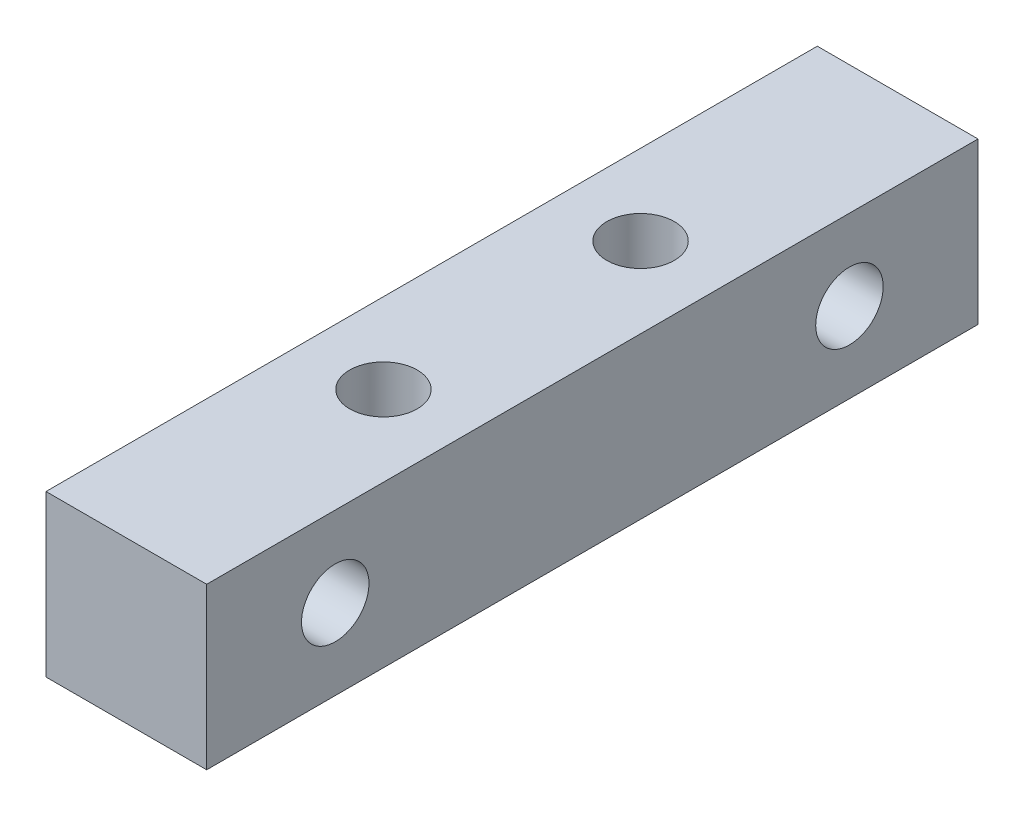
ISO-10303-21;
HEADER;
FILE_DESCRIPTION(('STEP AP214'),'2;1');
FILE_NAME('part.step','',(''),(''),'','','');
FILE_SCHEMA(('AUTOMOTIVE_DESIGN { 1 0 10303 214 1 1 1 1 }'));
ENDSEC;
DATA;
#1=APPLICATION_CONTEXT('core data for automotive mechanical design processes');
#2=APPLICATION_PROTOCOL_DEFINITION('international standard','automotive_design',2000,#1);
#3=PRODUCT_CONTEXT('',#1,'mechanical');
#4=PRODUCT('Part','Part','',(#3));
#5=PRODUCT_RELATED_PRODUCT_CATEGORY('part','',(#4));
#6=PRODUCT_DEFINITION_FORMATION('','',#4);
#7=PRODUCT_DEFINITION_CONTEXT('part definition',#1,'design');
#8=PRODUCT_DEFINITION('design','',#6,#7);
#9=PRODUCT_DEFINITION_SHAPE('','',#8);
#10=(LENGTH_UNIT() NAMED_UNIT(*) SI_UNIT(.MILLI.,.METRE.));
#11=(NAMED_UNIT(*) PLANE_ANGLE_UNIT() SI_UNIT($,.RADIAN.));
#12=(NAMED_UNIT(*) SI_UNIT($,.STERADIAN.) SOLID_ANGLE_UNIT());
#13=UNCERTAINTY_MEASURE_WITH_UNIT(LENGTH_MEASURE(1.E-05),#10,'distance_accuracy_value','');
#14=(GEOMETRIC_REPRESENTATION_CONTEXT(3) GLOBAL_UNCERTAINTY_ASSIGNED_CONTEXT((#13)) GLOBAL_UNIT_ASSIGNED_CONTEXT((#10,
#11,#12)) REPRESENTATION_CONTEXT('',''));
#15=CARTESIAN_POINT('',(0.,0.,0.));
#16=DIRECTION('',(0.,0.,1.));
#17=DIRECTION('',(1.,0.,0.));
#18=AXIS2_PLACEMENT_3D('',#15,#16,#17);
#19=CARTESIAN_POINT('',(0.,0.,48.));
#20=DIRECTION('',(1.,0.,0.));
#21=DIRECTION('',(0.,1.,0.));
#22=AXIS2_PLACEMENT_3D('',#19,#20,#21);
#23=PLANE('',#22);
#24=CARTESIAN_POINT('',(0.,-5.,40.));
#25=DIRECTION('',(1.,0.,0.));
#26=DIRECTION('',(0.,1.,0.));
#27=AXIS2_PLACEMENT_3D('',#24,#25,#26);
#28=CIRCLE('',#27,2.1);
#29=CARTESIAN_POINT('',(0.,-2.90000000000001,40.));
#30=VERTEX_POINT('',#29);
#31=EDGE_CURVE('E111',#30,#30,#28,.T.);
#32=ORIENTED_EDGE('',*,*,#31,.T.);
#33=EDGE_LOOP('',(#32));
#34=FACE_BOUND('',#33,.T.);
#35=CARTESIAN_POINT('',(0.,-5.,8.));
#36=DIRECTION('',(1.,0.,0.));
#37=DIRECTION('',(0.,1.,0.));
#38=AXIS2_PLACEMENT_3D('',#35,#36,#37);
#39=CIRCLE('',#38,2.1);
#40=CARTESIAN_POINT('',(0.,-2.90000000000001,8.));
#41=VERTEX_POINT('',#40);
#42=EDGE_CURVE('E131',#41,#41,#39,.T.);
#43=ORIENTED_EDGE('',*,*,#42,.T.);
#44=EDGE_LOOP('',(#43));
#45=FACE_BOUND('',#44,.T.);
#46=DIRECTION('',(0.,-1.,0.));
#47=VECTOR('',#46,1.);
#48=CARTESIAN_POINT('',(0.,0.,0.));
#49=LINE('',#48,#47);
#50=CARTESIAN_POINT('',(0.,0.,0.));
#51=VERTEX_POINT('',#50);
#52=CARTESIAN_POINT('',(0.,-10.,0.));
#53=VERTEX_POINT('',#52);
#54=EDGE_CURVE('E107',#51,#53,#49,.T.);
#55=ORIENTED_EDGE('',*,*,#54,.T.);
#56=DIRECTION('',(0.,0.,-1.));
#57=VECTOR('',#56,1.);
#58=CARTESIAN_POINT('',(0.,-10.,48.));
#59=LINE('',#58,#57);
#60=CARTESIAN_POINT('',(0.,-10.,48.));
#61=VERTEX_POINT('',#60);
#62=EDGE_CURVE('E11',#61,#53,#59,.T.);
#63=ORIENTED_EDGE('',*,*,#62,.F.);
#64=DIRECTION('',(0.,-1.,0.));
#65=VECTOR('',#64,1.);
#66=CARTESIAN_POINT('',(0.,0.,48.));
#67=LINE('',#66,#65);
#68=CARTESIAN_POINT('',(0.,0.,48.));
#69=VERTEX_POINT('',#68);
#70=EDGE_CURVE('E91',#69,#61,#67,.T.);
#71=ORIENTED_EDGE('',*,*,#70,.F.);
#72=DIRECTION('',(0.,0.,-1.));
#73=VECTOR('',#72,1.);
#74=CARTESIAN_POINT('',(0.,0.,48.));
#75=LINE('',#74,#73);
#76=EDGE_CURVE('E103',#69,#51,#75,.T.);
#77=ORIENTED_EDGE('',*,*,#76,.T.);
#78=EDGE_LOOP('',(#55,#63,#71,#77));
#79=FACE_BOUND('',#78,.T.);
#80=ADVANCED_FACE('F39',(#34,#45,#79),#23,.F.);
#81=CARTESIAN_POINT('',(0.,-10.,48.));
#82=DIRECTION('',(0.,1.,0.));
#83=DIRECTION('',(0.,0.,1.));
#84=AXIS2_PLACEMENT_3D('',#81,#82,#83);
#85=PLANE('',#84);
#86=CARTESIAN_POINT('',(5.,-10.,32.));
#87=DIRECTION('',(0.,1.,0.));
#88=DIRECTION('',(0.,0.,1.));
#89=AXIS2_PLACEMENT_3D('',#86,#87,#88);
#90=CIRCLE('',#89,2.1);
#91=CARTESIAN_POINT('',(5.,-10.,34.1));
#92=VERTEX_POINT('',#91);
#93=EDGE_CURVE('E140',#92,#92,#90,.T.);
#94=ORIENTED_EDGE('',*,*,#93,.T.);
#95=EDGE_LOOP('',(#94));
#96=FACE_BOUND('',#95,.T.);
#97=CARTESIAN_POINT('',(5.,-10.,16.));
#98=DIRECTION('',(0.,1.,0.));
#99=DIRECTION('',(0.,0.,1.));
#100=AXIS2_PLACEMENT_3D('',#97,#98,#99);
#101=CIRCLE('',#100,2.1);
#102=CARTESIAN_POINT('',(5.,-10.,18.1));
#103=VERTEX_POINT('',#102);
#104=EDGE_CURVE('E147',#103,#103,#101,.T.);
#105=ORIENTED_EDGE('',*,*,#104,.T.);
#106=EDGE_LOOP('',(#105));
#107=FACE_BOUND('',#106,.T.);
#108=DIRECTION('',(1.,0.,0.));
#109=VECTOR('',#108,1.);
#110=CARTESIAN_POINT('',(0.,-10.,0.));
#111=LINE('',#110,#109);
#112=CARTESIAN_POINT('',(10.,-10.,0.));
#113=VERTEX_POINT('',#112);
#114=EDGE_CURVE('E96',#53,#113,#111,.T.);
#115=ORIENTED_EDGE('',*,*,#114,.T.);
#116=DIRECTION('',(0.,0.,-1.));
#117=VECTOR('',#116,1.);
#118=CARTESIAN_POINT('',(10.,-10.,48.));
#119=LINE('',#118,#117);
#120=CARTESIAN_POINT('',(10.,-10.,48.));
#121=VERTEX_POINT('',#120);
#122=EDGE_CURVE('E48',#121,#113,#119,.T.);
#123=ORIENTED_EDGE('',*,*,#122,.F.);
#124=DIRECTION('',(1.,0.,0.));
#125=VECTOR('',#124,1.);
#126=CARTESIAN_POINT('',(0.,-10.,48.));
#127=LINE('',#126,#125);
#128=EDGE_CURVE('E86',#61,#121,#127,.T.);
#129=ORIENTED_EDGE('',*,*,#128,.F.);
#130=ORIENTED_EDGE('',*,*,#62,.T.);
#131=EDGE_LOOP('',(#115,#123,#129,#130));
#132=FACE_BOUND('',#131,.T.);
#133=ADVANCED_FACE('F95',(#96,#107,#132),#85,.F.);
#134=CARTESIAN_POINT('',(10.,0.,48.));
#135=DIRECTION('',(-1.,0.,0.));
#136=DIRECTION('',(0.,-1.,0.));
#137=AXIS2_PLACEMENT_3D('',#134,#135,#136);
#138=PLANE('',#137);
#139=CARTESIAN_POINT('',(10.,-5.,40.));
#140=DIRECTION('',(1.,0.,0.));
#141=DIRECTION('',(0.,1.,0.));
#142=AXIS2_PLACEMENT_3D('',#139,#140,#141);
#143=CIRCLE('',#142,2.1);
#144=CARTESIAN_POINT('',(10.,-2.9,40.));
#145=VERTEX_POINT('',#144);
#146=EDGE_CURVE('E135',#145,#145,#143,.T.);
#147=ORIENTED_EDGE('',*,*,#146,.F.);
#148=EDGE_LOOP('',(#147));
#149=FACE_BOUND('',#148,.T.);
#150=CARTESIAN_POINT('',(10.,-5.,8.));
#151=DIRECTION('',(1.,0.,0.));
#152=DIRECTION('',(0.,-1.,0.));
#153=AXIS2_PLACEMENT_3D('',#150,#151,#152);
#154=CIRCLE('',#153,2.1);
#155=CARTESIAN_POINT('',(10.,-7.1,8.));
#156=VERTEX_POINT('',#155);
#157=EDGE_CURVE('E136',#156,#156,#154,.T.);
#158=ORIENTED_EDGE('',*,*,#157,.F.);
#159=EDGE_LOOP('',(#158));
#160=FACE_BOUND('',#159,.T.);
#161=DIRECTION('',(0.,1.,0.));
#162=VECTOR('',#161,1.);
#163=CARTESIAN_POINT('',(10.,0.,0.));
#164=LINE('',#163,#162);
#165=CARTESIAN_POINT('',(10.,0.,0.));
#166=VERTEX_POINT('',#165);
#167=EDGE_CURVE('E73',#113,#166,#164,.T.);
#168=ORIENTED_EDGE('',*,*,#167,.T.);
#169=DIRECTION('',(0.,0.,-1.));
#170=VECTOR('',#169,1.);
#171=CARTESIAN_POINT('',(10.,0.,48.));
#172=LINE('',#171,#170);
#173=CARTESIAN_POINT('',(10.,0.,48.));
#174=VERTEX_POINT('',#173);
#175=EDGE_CURVE('E98',#174,#166,#172,.T.);
#176=ORIENTED_EDGE('',*,*,#175,.F.);
#177=DIRECTION('',(0.,1.,0.));
#178=VECTOR('',#177,1.);
#179=CARTESIAN_POINT('',(10.,0.,48.));
#180=LINE('',#179,#178);
#181=EDGE_CURVE('E89',#121,#174,#180,.T.);
#182=ORIENTED_EDGE('',*,*,#181,.F.);
#183=ORIENTED_EDGE('',*,*,#122,.T.);
#184=EDGE_LOOP('',(#168,#176,#182,#183));
#185=FACE_BOUND('',#184,.T.);
#186=ADVANCED_FACE('F99',(#149,#160,#185),#138,.F.);
#187=CARTESIAN_POINT('',(0.,0.,48.));
#188=DIRECTION('',(0.,-1.,0.));
#189=DIRECTION('',(0.,0.,-1.));
#190=AXIS2_PLACEMENT_3D('',#187,#188,#189);
#191=PLANE('',#190);
#192=CARTESIAN_POINT('',(5.,0.,32.));
#193=DIRECTION('',(0.,1.,0.));
#194=DIRECTION('',(0.,0.,-1.));
#195=AXIS2_PLACEMENT_3D('',#192,#193,#194);
#196=CIRCLE('',#195,2.1);
#197=CARTESIAN_POINT('',(5.,0.,29.9));
#198=VERTEX_POINT('',#197);
#199=EDGE_CURVE('E151',#198,#198,#196,.T.);
#200=ORIENTED_EDGE('',*,*,#199,.F.);
#201=EDGE_LOOP('',(#200));
#202=FACE_BOUND('',#201,.T.);
#203=CARTESIAN_POINT('',(5.,0.,16.));
#204=DIRECTION('',(0.,1.,0.));
#205=DIRECTION('',(0.,0.,1.));
#206=AXIS2_PLACEMENT_3D('',#203,#204,#205);
#207=CIRCLE('',#206,2.1);
#208=CARTESIAN_POINT('',(5.,0.,18.1));
#209=VERTEX_POINT('',#208);
#210=EDGE_CURVE('E152',#209,#209,#207,.T.);
#211=ORIENTED_EDGE('',*,*,#210,.F.);
#212=EDGE_LOOP('',(#211));
#213=FACE_BOUND('',#212,.T.);
#214=DIRECTION('',(-1.,0.,0.));
#215=VECTOR('',#214,1.);
#216=CARTESIAN_POINT('',(0.,0.,0.));
#217=LINE('',#216,#215);
#218=EDGE_CURVE('E79',#166,#51,#217,.T.);
#219=ORIENTED_EDGE('',*,*,#218,.T.);
#220=ORIENTED_EDGE('',*,*,#76,.F.);
#221=DIRECTION('',(-1.,0.,0.));
#222=VECTOR('',#221,1.);
#223=CARTESIAN_POINT('',(0.,0.,48.));
#224=LINE('',#223,#222);
#225=EDGE_CURVE('E56',#174,#69,#224,.T.);
#226=ORIENTED_EDGE('',*,*,#225,.F.);
#227=ORIENTED_EDGE('',*,*,#175,.T.);
#228=EDGE_LOOP('',(#219,#220,#226,#227));
#229=FACE_BOUND('',#228,.T.);
#230=ADVANCED_FACE('F121',(#202,#213,#229),#191,.F.);
#231=CARTESIAN_POINT('',(0.,0.,48.));
#232=DIRECTION('',(0.,0.,1.));
#233=DIRECTION('',(1.,0.,0.));
#234=AXIS2_PLACEMENT_3D('',#231,#232,#233);
#235=PLANE('',#234);
#236=ORIENTED_EDGE('',*,*,#70,.T.);
#237=ORIENTED_EDGE('',*,*,#128,.T.);
#238=ORIENTED_EDGE('',*,*,#181,.T.);
#239=ORIENTED_EDGE('',*,*,#225,.T.);
#240=EDGE_LOOP('',(#236,#237,#238,#239));
#241=FACE_BOUND('',#240,.T.);
#242=ADVANCED_FACE('F87',(#241),#235,.T.);
#243=CARTESIAN_POINT('',(0.,0.,0.));
#244=DIRECTION('',(0.,0.,1.));
#245=DIRECTION('',(1.,0.,0.));
#246=AXIS2_PLACEMENT_3D('',#243,#244,#245);
#247=PLANE('',#246);
#248=ORIENTED_EDGE('',*,*,#54,.F.);
#249=ORIENTED_EDGE('',*,*,#218,.F.);
#250=ORIENTED_EDGE('',*,*,#167,.F.);
#251=ORIENTED_EDGE('',*,*,#114,.F.);
#252=EDGE_LOOP('',(#248,#249,#250,#251));
#253=FACE_BOUND('',#252,.T.);
#254=ADVANCED_FACE('F124',(#253),#247,.F.);
#255=CARTESIAN_POINT('',(-38.,-5.00000000000002,8.));
#256=DIRECTION('',(1.,0.,0.));
#257=DIRECTION('',(0.,1.,0.));
#258=AXIS2_PLACEMENT_3D('',#255,#256,#257);
#259=CYLINDRICAL_SURFACE('',#258,2.1);
#260=ORIENTED_EDGE('',*,*,#157,.T.);
#261=EDGE_LOOP('',(#260));
#262=FACE_BOUND('',#261,.T.);
#263=ORIENTED_EDGE('',*,*,#42,.F.);
#264=EDGE_LOOP('',(#263));
#265=FACE_BOUND('',#264,.T.);
#266=ADVANCED_FACE('F187',(#262,#265),#259,.F.);
#267=CARTESIAN_POINT('',(-38.,-5.00000000000002,40.));
#268=DIRECTION('',(1.,0.,0.));
#269=DIRECTION('',(0.,1.,0.));
#270=AXIS2_PLACEMENT_3D('',#267,#268,#269);
#271=CYLINDRICAL_SURFACE('',#270,2.1);
#272=ORIENTED_EDGE('',*,*,#146,.T.);
#273=EDGE_LOOP('',(#272));
#274=FACE_BOUND('',#273,.T.);
#275=ORIENTED_EDGE('',*,*,#31,.F.);
#276=EDGE_LOOP('',(#275));
#277=FACE_BOUND('',#276,.T.);
#278=ADVANCED_FACE('F171',(#274,#277),#271,.F.);
#279=CARTESIAN_POINT('',(5.,-48.,16.));
#280=DIRECTION('',(0.,1.,0.));
#281=DIRECTION('',(0.,0.,1.));
#282=AXIS2_PLACEMENT_3D('',#279,#280,#281);
#283=CYLINDRICAL_SURFACE('',#282,2.1);
#284=ORIENTED_EDGE('',*,*,#210,.T.);
#285=EDGE_LOOP('',(#284));
#286=FACE_BOUND('',#285,.T.);
#287=ORIENTED_EDGE('',*,*,#104,.F.);
#288=EDGE_LOOP('',(#287));
#289=FACE_BOUND('',#288,.T.);
#290=ADVANCED_FACE('F168',(#286,#289),#283,.F.);
#291=CARTESIAN_POINT('',(5.,-48.,32.));
#292=DIRECTION('',(0.,1.,0.));
#293=DIRECTION('',(0.,0.,1.));
#294=AXIS2_PLACEMENT_3D('',#291,#292,#293);
#295=CYLINDRICAL_SURFACE('',#294,2.1);
#296=ORIENTED_EDGE('',*,*,#199,.T.);
#297=EDGE_LOOP('',(#296));
#298=FACE_BOUND('',#297,.T.);
#299=ORIENTED_EDGE('',*,*,#93,.F.);
#300=EDGE_LOOP('',(#299));
#301=FACE_BOUND('',#300,.T.);
#302=ADVANCED_FACE('F160',(#298,#301),#295,.F.);
#303=CLOSED_SHELL('',(#80,#133,#186,#230,#242,#254,#266,#278,#290,#302));
#304=MANIFOLD_SOLID_BREP('B2',#303);
#305=ADVANCED_BREP_SHAPE_REPRESENTATION('',(#18,#304),#14);
#306=SHAPE_DEFINITION_REPRESENTATION(#9,#305);
ENDSEC;
END-ISO-10303-21;
